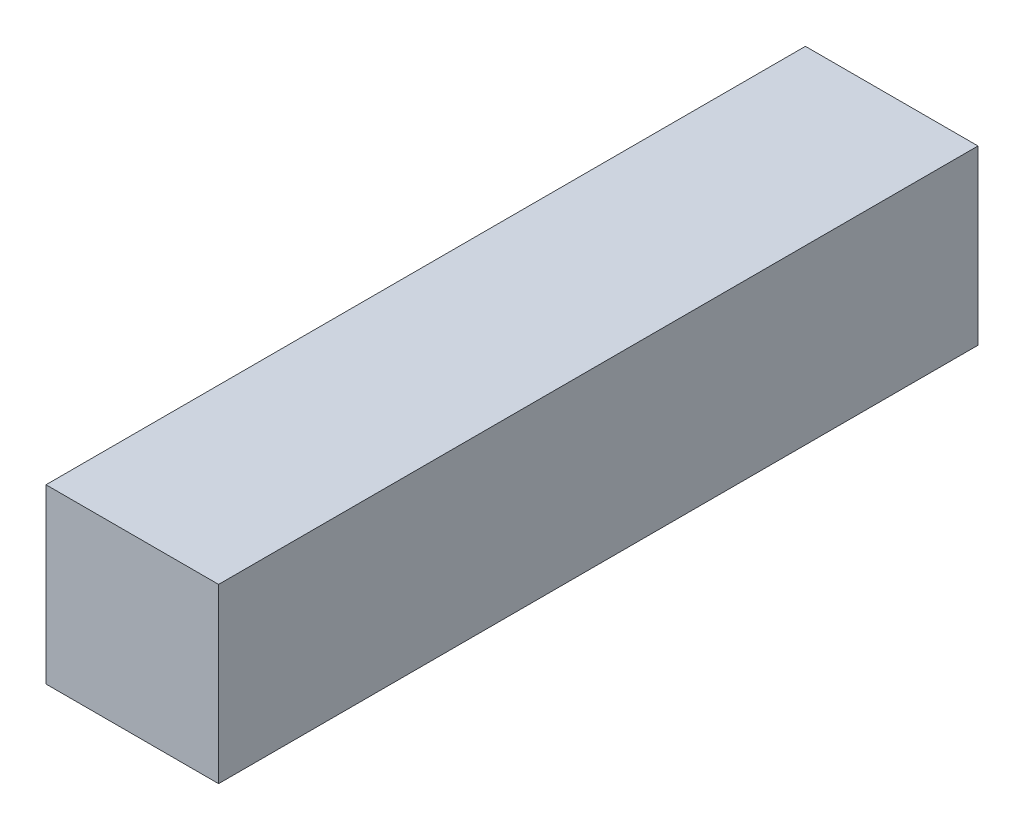
ISO-10303-21;
HEADER;
FILE_DESCRIPTION(('STEP AP214'),'2;1');
FILE_NAME('part.step','',(''),(''),'','','');
FILE_SCHEMA(('AUTOMOTIVE_DESIGN { 1 0 10303 214 1 1 1 1 }'));
ENDSEC;
DATA;
#1=APPLICATION_CONTEXT('core data for automotive mechanical design processes');
#2=APPLICATION_PROTOCOL_DEFINITION('international standard','automotive_design',2000,#1);
#3=PRODUCT_CONTEXT('',#1,'mechanical');
#4=PRODUCT('Part','Part','',(#3));
#5=PRODUCT_RELATED_PRODUCT_CATEGORY('part','',(#4));
#6=PRODUCT_DEFINITION_FORMATION('','',#4);
#7=PRODUCT_DEFINITION_CONTEXT('part definition',#1,'design');
#8=PRODUCT_DEFINITION('design','',#6,#7);
#9=PRODUCT_DEFINITION_SHAPE('','',#8);
#10=(LENGTH_UNIT() NAMED_UNIT(*) SI_UNIT(.MILLI.,.METRE.));
#11=(NAMED_UNIT(*) PLANE_ANGLE_UNIT() SI_UNIT($,.RADIAN.));
#12=(NAMED_UNIT(*) SI_UNIT($,.STERADIAN.) SOLID_ANGLE_UNIT());
#13=UNCERTAINTY_MEASURE_WITH_UNIT(LENGTH_MEASURE(1.E-05),#10,'distance_accuracy_value','');
#14=(GEOMETRIC_REPRESENTATION_CONTEXT(3) GLOBAL_UNCERTAINTY_ASSIGNED_CONTEXT((#13)) GLOBAL_UNIT_ASSIGNED_CONTEXT((#10,
#11,#12)) REPRESENTATION_CONTEXT('',''));
#15=CARTESIAN_POINT('',(0.,0.,0.));
#16=DIRECTION('',(0.,0.,1.));
#17=DIRECTION('',(1.,0.,0.));
#18=AXIS2_PLACEMENT_3D('',#15,#16,#17);
#19=CARTESIAN_POINT('',(12.5,0.,55.));
#20=DIRECTION('',(0.,-1.,0.));
#21=DIRECTION('',(1.,0.,0.));
#22=AXIS2_PLACEMENT_3D('',#19,#20,#21);
#23=PLANE('',#22);
#24=DIRECTION('',(-1.,0.,0.));
#25=VECTOR('',#24,1.);
#26=CARTESIAN_POINT('',(12.5,0.,0.));
#27=LINE('',#26,#25);
#28=CARTESIAN_POINT('',(12.5,0.,0.));
#29=VERTEX_POINT('',#28);
#30=CARTESIAN_POINT('',(0.,0.,0.));
#31=VERTEX_POINT('',#30);
#32=EDGE_CURVE('E107',#29,#31,#27,.T.);
#33=ORIENTED_EDGE('',*,*,#32,.T.);
#34=DIRECTION('',(0.,0.,-1.));
#35=VECTOR('',#34,1.);
#36=CARTESIAN_POINT('',(0.,0.,55.));
#37=LINE('',#36,#35);
#38=CARTESIAN_POINT('',(0.,0.,55.));
#39=VERTEX_POINT('',#38);
#40=EDGE_CURVE('E11',#39,#31,#37,.T.);
#41=ORIENTED_EDGE('',*,*,#40,.F.);
#42=DIRECTION('',(-1.,0.,0.));
#43=VECTOR('',#42,1.);
#44=CARTESIAN_POINT('',(12.5,0.,55.));
#45=LINE('',#44,#43);
#46=CARTESIAN_POINT('',(12.5,0.,55.));
#47=VERTEX_POINT('',#46);
#48=EDGE_CURVE('E91',#47,#39,#45,.T.);
#49=ORIENTED_EDGE('',*,*,#48,.F.);
#50=DIRECTION('',(0.,0.,-1.));
#51=VECTOR('',#50,1.);
#52=CARTESIAN_POINT('',(12.5,0.,55.));
#53=LINE('',#52,#51);
#54=EDGE_CURVE('E103',#47,#29,#53,.T.);
#55=ORIENTED_EDGE('',*,*,#54,.T.);
#56=EDGE_LOOP('',(#33,#41,#49,#55));
#57=FACE_BOUND('',#56,.T.);
#58=ADVANCED_FACE('F39',(#57),#23,.F.);
#59=CARTESIAN_POINT('',(0.,0.,55.));
#60=DIRECTION('',(1.,0.,0.));
#61=DIRECTION('',(0.,1.,0.));
#62=AXIS2_PLACEMENT_3D('',#59,#60,#61);
#63=PLANE('',#62);
#64=DIRECTION('',(0.,-1.,0.));
#65=VECTOR('',#64,1.);
#66=CARTESIAN_POINT('',(0.,0.,0.));
#67=LINE('',#66,#65);
#68=CARTESIAN_POINT('',(0.,-12.5,0.));
#69=VERTEX_POINT('',#68);
#70=EDGE_CURVE('E96',#31,#69,#67,.T.);
#71=ORIENTED_EDGE('',*,*,#70,.T.);
#72=DIRECTION('',(0.,0.,-1.));
#73=VECTOR('',#72,1.);
#74=CARTESIAN_POINT('',(0.,-12.5,55.));
#75=LINE('',#74,#73);
#76=CARTESIAN_POINT('',(0.,-12.5,55.));
#77=VERTEX_POINT('',#76);
#78=EDGE_CURVE('E48',#77,#69,#75,.T.);
#79=ORIENTED_EDGE('',*,*,#78,.F.);
#80=DIRECTION('',(0.,-1.,0.));
#81=VECTOR('',#80,1.);
#82=CARTESIAN_POINT('',(0.,0.,55.));
#83=LINE('',#82,#81);
#84=EDGE_CURVE('E86',#39,#77,#83,.T.);
#85=ORIENTED_EDGE('',*,*,#84,.F.);
#86=ORIENTED_EDGE('',*,*,#40,.T.);
#87=EDGE_LOOP('',(#71,#79,#85,#86));
#88=FACE_BOUND('',#87,.T.);
#89=ADVANCED_FACE('F95',(#88),#63,.F.);
#90=CARTESIAN_POINT('',(0.,-12.5,55.));
#91=DIRECTION('',(0.,1.,0.));
#92=DIRECTION('',(0.,0.,1.));
#93=AXIS2_PLACEMENT_3D('',#90,#91,#92);
#94=PLANE('',#93);
#95=DIRECTION('',(1.,0.,0.));
#96=VECTOR('',#95,1.);
#97=CARTESIAN_POINT('',(0.,-12.5,0.));
#98=LINE('',#97,#96);
#99=CARTESIAN_POINT('',(12.5,-12.5,0.));
#100=VERTEX_POINT('',#99);
#101=EDGE_CURVE('E73',#69,#100,#98,.T.);
#102=ORIENTED_EDGE('',*,*,#101,.T.);
#103=DIRECTION('',(0.,0.,-1.));
#104=VECTOR('',#103,1.);
#105=CARTESIAN_POINT('',(12.5,-12.5,55.));
#106=LINE('',#105,#104);
#107=CARTESIAN_POINT('',(12.5,-12.5,55.));
#108=VERTEX_POINT('',#107);
#109=EDGE_CURVE('E98',#108,#100,#106,.T.);
#110=ORIENTED_EDGE('',*,*,#109,.F.);
#111=DIRECTION('',(1.,0.,0.));
#112=VECTOR('',#111,1.);
#113=CARTESIAN_POINT('',(0.,-12.5,55.));
#114=LINE('',#113,#112);
#115=EDGE_CURVE('E89',#77,#108,#114,.T.);
#116=ORIENTED_EDGE('',*,*,#115,.F.);
#117=ORIENTED_EDGE('',*,*,#78,.T.);
#118=EDGE_LOOP('',(#102,#110,#116,#117));
#119=FACE_BOUND('',#118,.T.);
#120=ADVANCED_FACE('F99',(#119),#94,.F.);
#121=CARTESIAN_POINT('',(12.5,-12.5,55.));
#122=DIRECTION('',(-1.,0.,0.));
#123=DIRECTION('',(0.,0.,1.));
#124=AXIS2_PLACEMENT_3D('',#121,#122,#123);
#125=PLANE('',#124);
#126=DIRECTION('',(0.,1.,0.));
#127=VECTOR('',#126,1.);
#128=CARTESIAN_POINT('',(12.5,-12.5,0.));
#129=LINE('',#128,#127);
#130=EDGE_CURVE('E79',#100,#29,#129,.T.);
#131=ORIENTED_EDGE('',*,*,#130,.T.);
#132=ORIENTED_EDGE('',*,*,#54,.F.);
#133=DIRECTION('',(0.,1.,0.));
#134=VECTOR('',#133,1.);
#135=CARTESIAN_POINT('',(12.5,-12.5,55.));
#136=LINE('',#135,#134);
#137=EDGE_CURVE('E56',#108,#47,#136,.T.);
#138=ORIENTED_EDGE('',*,*,#137,.F.);
#139=ORIENTED_EDGE('',*,*,#109,.T.);
#140=EDGE_LOOP('',(#131,#132,#138,#139));
#141=FACE_BOUND('',#140,.T.);
#142=ADVANCED_FACE('F120',(#141),#125,.F.);
#143=CARTESIAN_POINT('',(0.,0.,55.));
#144=DIRECTION('',(0.,0.,1.));
#145=DIRECTION('',(1.,0.,0.));
#146=AXIS2_PLACEMENT_3D('',#143,#144,#145);
#147=PLANE('',#146);
#148=ORIENTED_EDGE('',*,*,#48,.T.);
#149=ORIENTED_EDGE('',*,*,#84,.T.);
#150=ORIENTED_EDGE('',*,*,#115,.T.);
#151=ORIENTED_EDGE('',*,*,#137,.T.);
#152=EDGE_LOOP('',(#148,#149,#150,#151));
#153=FACE_BOUND('',#152,.T.);
#154=ADVANCED_FACE('F87',(#153),#147,.T.);
#155=CARTESIAN_POINT('',(0.,0.,0.));
#156=DIRECTION('',(0.,0.,1.));
#157=DIRECTION('',(1.,0.,0.));
#158=AXIS2_PLACEMENT_3D('',#155,#156,#157);
#159=PLANE('',#158);
#160=ORIENTED_EDGE('',*,*,#32,.F.);
#161=ORIENTED_EDGE('',*,*,#130,.F.);
#162=ORIENTED_EDGE('',*,*,#101,.F.);
#163=ORIENTED_EDGE('',*,*,#70,.F.);
#164=EDGE_LOOP('',(#160,#161,#162,#163));
#165=FACE_BOUND('',#164,.T.);
#166=ADVANCED_FACE('F123',(#165),#159,.F.);
#167=CLOSED_SHELL('',(#58,#89,#120,#142,#154,#166));
#168=MANIFOLD_SOLID_BREP('B2',#167);
#169=ADVANCED_BREP_SHAPE_REPRESENTATION('',(#18,#168),#14);
#170=SHAPE_DEFINITION_REPRESENTATION(#9,#169);
ENDSEC;
END-ISO-10303-21;
